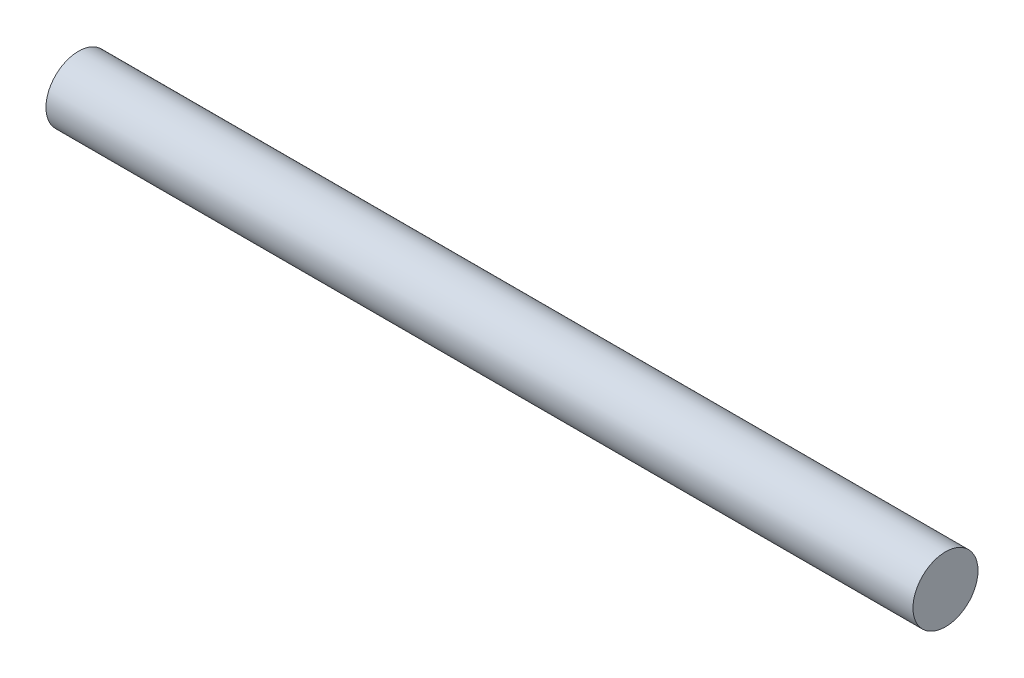
ISO-10303-21;
HEADER;
FILE_DESCRIPTION(('STEP AP214'),'2;1');
FILE_NAME('part.step','',(''),(''),'','','');
FILE_SCHEMA(('AUTOMOTIVE_DESIGN { 1 0 10303 214 1 1 1 1 }'));
ENDSEC;
DATA;
#1=APPLICATION_CONTEXT('core data for automotive mechanical design processes');
#2=APPLICATION_PROTOCOL_DEFINITION('international standard','automotive_design',2000,#1);
#3=PRODUCT_CONTEXT('',#1,'mechanical');
#4=PRODUCT('Part','Part','',(#3));
#5=PRODUCT_RELATED_PRODUCT_CATEGORY('part','',(#4));
#6=PRODUCT_DEFINITION_FORMATION('','',#4);
#7=PRODUCT_DEFINITION_CONTEXT('part definition',#1,'design');
#8=PRODUCT_DEFINITION('design','',#6,#7);
#9=PRODUCT_DEFINITION_SHAPE('','',#8);
#10=(LENGTH_UNIT() NAMED_UNIT(*) SI_UNIT(.MILLI.,.METRE.));
#11=(NAMED_UNIT(*) PLANE_ANGLE_UNIT() SI_UNIT($,.RADIAN.));
#12=(NAMED_UNIT(*) SI_UNIT($,.STERADIAN.) SOLID_ANGLE_UNIT());
#13=UNCERTAINTY_MEASURE_WITH_UNIT(LENGTH_MEASURE(1.E-05),#10,'distance_accuracy_value','');
#14=(GEOMETRIC_REPRESENTATION_CONTEXT(3) GLOBAL_UNCERTAINTY_ASSIGNED_CONTEXT((#13)) GLOBAL_UNIT_ASSIGNED_CONTEXT((#10,
#11,#12)) REPRESENTATION_CONTEXT('',''));
#15=CARTESIAN_POINT('',(0.,0.,0.));
#16=DIRECTION('',(0.,0.,1.));
#17=DIRECTION('',(1.,0.,0.));
#18=AXIS2_PLACEMENT_3D('',#15,#16,#17);
#19=CARTESIAN_POINT('',(5.,0.,0.));
#20=DIRECTION('',(-1.,0.,0.));
#21=DIRECTION('',(0.,0.,1.));
#22=AXIS2_PLACEMENT_3D('',#19,#20,#21);
#23=CYLINDRICAL_SURFACE('',#22,0.375);
#24=CARTESIAN_POINT('',(5.,0.,0.));
#25=DIRECTION('',(1.,0.,0.));
#26=DIRECTION('',(0.,0.,-1.));
#27=AXIS2_PLACEMENT_3D('',#24,#25,#26);
#28=CIRCLE('',#27,0.375);
#29=CARTESIAN_POINT('',(5.,0.,-0.375));
#30=VERTEX_POINT('',#29);
#31=EDGE_CURVE('E10',#30,#30,#28,.T.);
#32=ORIENTED_EDGE('',*,*,#31,.F.);
#33=EDGE_LOOP('',(#32));
#34=FACE_BOUND('',#33,.T.);
#35=CARTESIAN_POINT('',(-5.,0.,0.));
#36=DIRECTION('',(1.,0.,0.));
#37=DIRECTION('',(0.,0.,-1.));
#38=AXIS2_PLACEMENT_3D('',#35,#36,#37);
#39=CIRCLE('',#38,0.375);
#40=CARTESIAN_POINT('',(-5.,0.,-0.375));
#41=VERTEX_POINT('',#40);
#42=EDGE_CURVE('E44',#41,#41,#39,.T.);
#43=ORIENTED_EDGE('',*,*,#42,.T.);
#44=EDGE_LOOP('',(#43));
#45=FACE_BOUND('',#44,.T.);
#46=ADVANCED_FACE('F41',(#34,#45),#23,.T.);
#47=CARTESIAN_POINT('',(5.,0.,0.));
#48=DIRECTION('',(1.,0.,0.));
#49=DIRECTION('',(0.,0.,-1.));
#50=AXIS2_PLACEMENT_3D('',#47,#48,#49);
#51=PLANE('',#50);
#52=ORIENTED_EDGE('',*,*,#31,.T.);
#53=EDGE_LOOP('',(#52));
#54=FACE_BOUND('',#53,.T.);
#55=ADVANCED_FACE('F58',(#54),#51,.T.);
#56=CARTESIAN_POINT('',(-5.,0.,0.));
#57=DIRECTION('',(1.,0.,0.));
#58=DIRECTION('',(0.,0.,-1.));
#59=AXIS2_PLACEMENT_3D('',#56,#57,#58);
#60=PLANE('',#59);
#61=ORIENTED_EDGE('',*,*,#42,.F.);
#62=EDGE_LOOP('',(#61));
#63=FACE_BOUND('',#62,.T.);
#64=ADVANCED_FACE('F56',(#63),#60,.F.);
#65=CLOSED_SHELL('',(#46,#55,#64));
#66=MANIFOLD_SOLID_BREP('B2',#65);
#67=ADVANCED_BREP_SHAPE_REPRESENTATION('',(#18,#66),#14);
#68=SHAPE_DEFINITION_REPRESENTATION(#9,#67);
ENDSEC;
END-ISO-10303-21;
